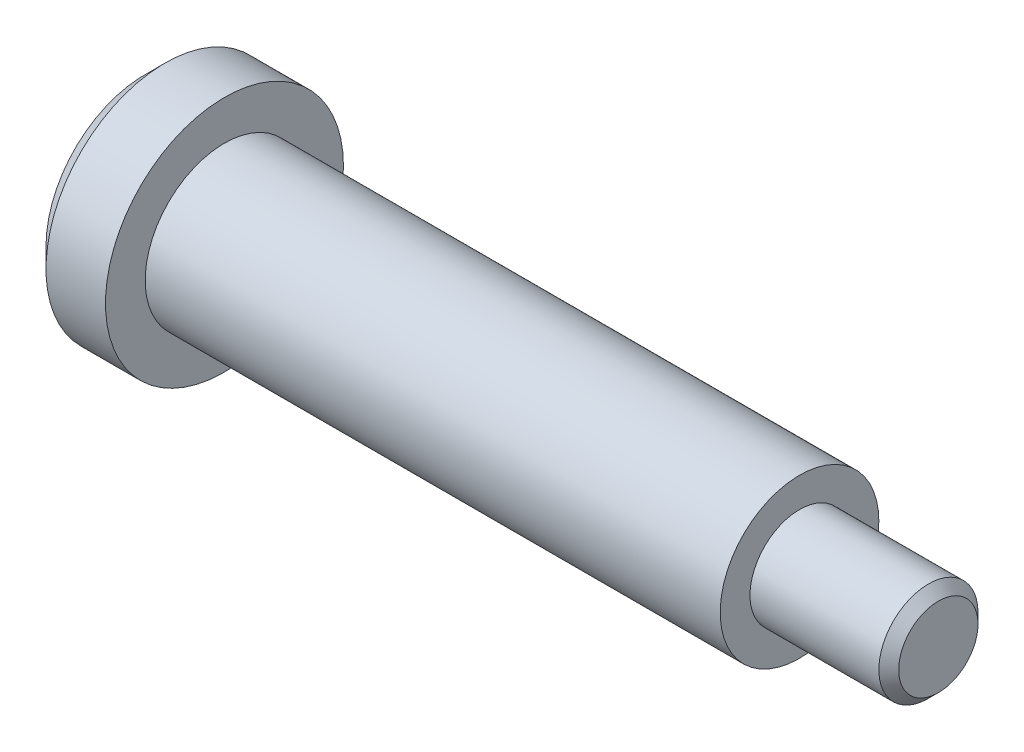
ISO-10303-21;
HEADER;
FILE_DESCRIPTION(('STEP AP214'),'2;1');
FILE_NAME('part.step','',(''),(''),'','','');
FILE_SCHEMA(('AUTOMOTIVE_DESIGN { 1 0 10303 214 1 1 1 1 }'));
ENDSEC;
DATA;
#1=APPLICATION_CONTEXT('core data for automotive mechanical design processes');
#2=APPLICATION_PROTOCOL_DEFINITION('international standard','automotive_design',2000,#1);
#3=PRODUCT_CONTEXT('',#1,'mechanical');
#4=PRODUCT('Part','Part','',(#3));
#5=PRODUCT_RELATED_PRODUCT_CATEGORY('part','',(#4));
#6=PRODUCT_DEFINITION_FORMATION('','',#4);
#7=PRODUCT_DEFINITION_CONTEXT('part definition',#1,'design');
#8=PRODUCT_DEFINITION('design','',#6,#7);
#9=PRODUCT_DEFINITION_SHAPE('','',#8);
#10=(LENGTH_UNIT() NAMED_UNIT(*) SI_UNIT(.MILLI.,.METRE.));
#11=(NAMED_UNIT(*) PLANE_ANGLE_UNIT() SI_UNIT($,.RADIAN.));
#12=(NAMED_UNIT(*) SI_UNIT($,.STERADIAN.) SOLID_ANGLE_UNIT());
#13=UNCERTAINTY_MEASURE_WITH_UNIT(LENGTH_MEASURE(1.E-05),#10,'distance_accuracy_value','');
#14=(GEOMETRIC_REPRESENTATION_CONTEXT(3) GLOBAL_UNCERTAINTY_ASSIGNED_CONTEXT((#13)) GLOBAL_UNIT_ASSIGNED_CONTEXT((#10,
#11,#12)) REPRESENTATION_CONTEXT('',''));
#15=CARTESIAN_POINT('',(0.,0.,0.));
#16=DIRECTION('',(0.,0.,1.));
#17=DIRECTION('',(1.,0.,0.));
#18=AXIS2_PLACEMENT_3D('',#15,#16,#17);
#19=CARTESIAN_POINT('',(4.,0.,0.));
#20=DIRECTION('',(-1.,0.,0.));
#21=DIRECTION('',(0.,0.,1.));
#22=AXIS2_PLACEMENT_3D('',#19,#20,#21);
#23=CYLINDRICAL_SURFACE('',#22,6.);
#24=CARTESIAN_POINT('',(0.999999999999999,0.,0.));
#25=DIRECTION('',(1.,0.,0.));
#26=DIRECTION('',(0.,0.,-1.));
#27=AXIS2_PLACEMENT_3D('',#24,#25,#26);
#28=CIRCLE('',#27,6.);
#29=CARTESIAN_POINT('',(0.999999999999999,0.,-6.));
#30=VERTEX_POINT('',#29);
#31=EDGE_CURVE('E45',#30,#30,#28,.T.);
#32=ORIENTED_EDGE('',*,*,#31,.T.);
#33=EDGE_LOOP('',(#32));
#34=FACE_BOUND('',#33,.T.);
#35=CARTESIAN_POINT('',(4.,0.,0.));
#36=DIRECTION('',(1.,0.,0.));
#37=DIRECTION('',(0.,0.,-1.));
#38=AXIS2_PLACEMENT_3D('',#35,#36,#37);
#39=CIRCLE('',#38,6.);
#40=CARTESIAN_POINT('',(4.,0.,-6.));
#41=VERTEX_POINT('',#40);
#42=EDGE_CURVE('E57',#41,#41,#39,.T.);
#43=ORIENTED_EDGE('',*,*,#42,.F.);
#44=EDGE_LOOP('',(#43));
#45=FACE_BOUND('',#44,.T.);
#46=ADVANCED_FACE('F30',(#34,#45),#23,.T.);
#47=CARTESIAN_POINT('',(4.,0.,0.));
#48=DIRECTION('',(1.,0.,0.));
#49=DIRECTION('',(0.,0.,-1.));
#50=AXIS2_PLACEMENT_3D('',#47,#48,#49);
#51=PLANE('',#50);
#52=CARTESIAN_POINT('',(4.,0.,0.));
#53=DIRECTION('',(1.,0.,0.));
#54=DIRECTION('',(0.,0.,-1.));
#55=AXIS2_PLACEMENT_3D('',#52,#53,#54);
#56=CIRCLE('',#55,4.);
#57=CARTESIAN_POINT('',(4.,0.,-4.));
#58=VERTEX_POINT('',#57);
#59=EDGE_CURVE('E60',#58,#58,#56,.T.);
#60=ORIENTED_EDGE('',*,*,#59,.F.);
#61=EDGE_LOOP('',(#60));
#62=FACE_BOUND('',#61,.T.);
#63=ORIENTED_EDGE('',*,*,#42,.T.);
#64=EDGE_LOOP('',(#63));
#65=FACE_BOUND('',#64,.T.);
#66=ADVANCED_FACE('F87',(#62,#65),#51,.T.);
#67=CARTESIAN_POINT('',(0.,0.,0.));
#68=DIRECTION('',(1.,0.,0.));
#69=DIRECTION('',(0.,0.,-1.));
#70=AXIS2_PLACEMENT_3D('',#67,#68,#69);
#71=PLANE('',#70);
#72=CARTESIAN_POINT('',(0.,0.,0.));
#73=DIRECTION('',(1.,0.,0.));
#74=DIRECTION('',(0.,0.,-1.));
#75=AXIS2_PLACEMENT_3D('',#72,#73,#74);
#76=CIRCLE('',#75,3.);
#77=CARTESIAN_POINT('',(0.,0.,-3.));
#78=VERTEX_POINT('',#77);
#79=EDGE_CURVE('E10',#78,#78,#76,.T.);
#80=ORIENTED_EDGE('',*,*,#79,.T.);
#81=EDGE_LOOP('',(#80));
#82=FACE_BOUND('',#81,.T.);
#83=CARTESIAN_POINT('',(0.,0.,0.));
#84=DIRECTION('',(1.,0.,0.));
#85=DIRECTION('',(0.,0.,-1.));
#86=AXIS2_PLACEMENT_3D('',#83,#84,#85);
#87=CIRCLE('',#86,5.);
#88=CARTESIAN_POINT('',(0.,0.,-5.));
#89=VERTEX_POINT('',#88);
#90=EDGE_CURVE('E41',#89,#89,#87,.F.);
#91=ORIENTED_EDGE('',*,*,#90,.T.);
#92=EDGE_LOOP('',(#91));
#93=FACE_BOUND('',#92,.T.);
#94=ADVANCED_FACE('F93',(#82,#93),#71,.F.);
#95=CARTESIAN_POINT('',(33.,0.,0.));
#96=DIRECTION('',(-1.,0.,0.));
#97=DIRECTION('',(0.,0.,1.));
#98=AXIS2_PLACEMENT_3D('',#95,#96,#97);
#99=CYLINDRICAL_SURFACE('',#98,4.);
#100=CARTESIAN_POINT('',(33.,0.,0.));
#101=DIRECTION('',(1.,0.,0.));
#102=DIRECTION('',(0.,0.,-1.));
#103=AXIS2_PLACEMENT_3D('',#100,#101,#102);
#104=CIRCLE('',#103,4.);
#105=CARTESIAN_POINT('',(33.,0.,-4.));
#106=VERTEX_POINT('',#105);
#107=EDGE_CURVE('E61',#106,#106,#104,.T.);
#108=ORIENTED_EDGE('',*,*,#107,.F.);
#109=EDGE_LOOP('',(#108));
#110=FACE_BOUND('',#109,.T.);
#111=ORIENTED_EDGE('',*,*,#59,.T.);
#112=EDGE_LOOP('',(#111));
#113=FACE_BOUND('',#112,.T.);
#114=ADVANCED_FACE('F119',(#110,#113),#99,.T.);
#115=CARTESIAN_POINT('',(33.,0.,0.));
#116=DIRECTION('',(1.,0.,0.));
#117=DIRECTION('',(0.,0.,-1.));
#118=AXIS2_PLACEMENT_3D('',#115,#116,#117);
#119=PLANE('',#118);
#120=CARTESIAN_POINT('',(33.,0.,0.));
#121=DIRECTION('',(1.,0.,0.));
#122=DIRECTION('',(0.,0.,-1.));
#123=AXIS2_PLACEMENT_3D('',#120,#121,#122);
#124=CIRCLE('',#123,2.5);
#125=CARTESIAN_POINT('',(33.,0.,-2.5));
#126=VERTEX_POINT('',#125);
#127=EDGE_CURVE('E56',#126,#126,#124,.T.);
#128=ORIENTED_EDGE('',*,*,#127,.F.);
#129=EDGE_LOOP('',(#128));
#130=FACE_BOUND('',#129,.T.);
#131=ORIENTED_EDGE('',*,*,#107,.T.);
#132=EDGE_LOOP('',(#131));
#133=FACE_BOUND('',#132,.T.);
#134=ADVANCED_FACE('F113',(#130,#133),#119,.T.);
#135=CARTESIAN_POINT('',(40.,0.,0.));
#136=DIRECTION('',(-1.,0.,0.));
#137=DIRECTION('',(0.,0.,1.));
#138=AXIS2_PLACEMENT_3D('',#135,#136,#137);
#139=CYLINDRICAL_SURFACE('',#138,2.5);
#140=CARTESIAN_POINT('',(39.5,0.,0.));
#141=DIRECTION('',(1.,0.,0.));
#142=DIRECTION('',(0.,0.,-1.));
#143=AXIS2_PLACEMENT_3D('',#140,#141,#142);
#144=CIRCLE('',#143,2.5);
#145=CARTESIAN_POINT('',(39.5,0.,-2.5));
#146=VERTEX_POINT('',#145);
#147=EDGE_CURVE('E50',#146,#146,#144,.F.);
#148=ORIENTED_EDGE('',*,*,#147,.T.);
#149=EDGE_LOOP('',(#148));
#150=FACE_BOUND('',#149,.T.);
#151=ORIENTED_EDGE('',*,*,#127,.T.);
#152=EDGE_LOOP('',(#151));
#153=FACE_BOUND('',#152,.T.);
#154=ADVANCED_FACE('F105',(#150,#153),#139,.T.);
#155=CARTESIAN_POINT('',(40.,0.,0.));
#156=DIRECTION('',(1.,0.,0.));
#157=DIRECTION('',(0.,0.,-1.));
#158=AXIS2_PLACEMENT_3D('',#155,#156,#157);
#159=PLANE('',#158);
#160=CARTESIAN_POINT('',(40.,0.,0.));
#161=DIRECTION('',(1.,0.,0.));
#162=DIRECTION('',(0.,0.,-1.));
#163=AXIS2_PLACEMENT_3D('',#160,#161,#162);
#164=CIRCLE('',#163,2.);
#165=CARTESIAN_POINT('',(40.,0.,-2.));
#166=VERTEX_POINT('',#165);
#167=EDGE_CURVE('E53',#166,#166,#164,.T.);
#168=ORIENTED_EDGE('',*,*,#167,.T.);
#169=EDGE_LOOP('',(#168));
#170=FACE_BOUND('',#169,.T.);
#171=ADVANCED_FACE('F100',(#170),#159,.T.);
#172=CARTESIAN_POINT('',(40.,0.,0.));
#173=DIRECTION('',(-1.,0.,0.));
#174=DIRECTION('',(0.,0.,1.));
#175=AXIS2_PLACEMENT_3D('',#172,#173,#174);
#176=CONICAL_SURFACE('',#175,2.,0.785398163397446);
#177=ORIENTED_EDGE('',*,*,#147,.F.);
#178=EDGE_LOOP('',(#177));
#179=FACE_BOUND('',#178,.T.);
#180=ORIENTED_EDGE('',*,*,#167,.F.);
#181=EDGE_LOOP('',(#180));
#182=FACE_BOUND('',#181,.T.);
#183=ADVANCED_FACE('F83',(#179,#182),#176,.T.);
#184=CARTESIAN_POINT('',(0.999999999999999,0.,0.));
#185=DIRECTION('',(1.,0.,0.));
#186=DIRECTION('',(0.,0.,-1.));
#187=AXIS2_PLACEMENT_3D('',#184,#185,#186);
#188=CONICAL_SURFACE('',#187,6.,0.78539816339745);
#189=ORIENTED_EDGE('',*,*,#90,.F.);
#190=EDGE_LOOP('',(#189));
#191=FACE_BOUND('',#190,.T.);
#192=ORIENTED_EDGE('',*,*,#31,.F.);
#193=EDGE_LOOP('',(#192));
#194=FACE_BOUND('',#193,.T.);
#195=ADVANCED_FACE('F76',(#191,#194),#188,.T.);
#196=CARTESIAN_POINT('',(1.,0.,0.));
#197=DIRECTION('',(-1.,0.,0.));
#198=DIRECTION('',(0.,0.,1.));
#199=AXIS2_PLACEMENT_3D('',#196,#197,#198);
#200=CYLINDRICAL_SURFACE('',#199,2.5);
#201=CARTESIAN_POINT('',(0.5,0.,0.));
#202=DIRECTION('',(1.,0.,0.));
#203=DIRECTION('',(0.,0.,-1.));
#204=AXIS2_PLACEMENT_3D('',#201,#202,#203);
#205=CIRCLE('',#204,2.5);
#206=CARTESIAN_POINT('',(0.5,0.,-2.5));
#207=VERTEX_POINT('',#206);
#208=EDGE_CURVE('E37',#207,#207,#205,.F.);
#209=ORIENTED_EDGE('',*,*,#208,.T.);
#210=EDGE_LOOP('',(#209));
#211=FACE_BOUND('',#210,.T.);
#212=CARTESIAN_POINT('',(1.,0.,0.));
#213=DIRECTION('',(-1.,0.,0.));
#214=DIRECTION('',(0.,0.,1.));
#215=AXIS2_PLACEMENT_3D('',#212,#213,#214);
#216=CIRCLE('',#215,2.5);
#217=CARTESIAN_POINT('',(1.,0.,2.5));
#218=VERTEX_POINT('',#217);
#219=EDGE_CURVE('E66',#218,#218,#216,.T.);
#220=ORIENTED_EDGE('',*,*,#219,.F.);
#221=EDGE_LOOP('',(#220));
#222=FACE_BOUND('',#221,.T.);
#223=ADVANCED_FACE('F74',(#211,#222),#200,.F.);
#224=CARTESIAN_POINT('',(1.,0.,0.));
#225=DIRECTION('',(-1.,0.,0.));
#226=DIRECTION('',(0.,0.,1.));
#227=AXIS2_PLACEMENT_3D('',#224,#225,#226);
#228=PLANE('',#227);
#229=ORIENTED_EDGE('',*,*,#219,.T.);
#230=EDGE_LOOP('',(#229));
#231=FACE_BOUND('',#230,.T.);
#232=ADVANCED_FACE('F72',(#231),#228,.T.);
#233=CARTESIAN_POINT('',(0.5,0.,0.));
#234=DIRECTION('',(1.,0.,0.));
#235=DIRECTION('',(0.,0.,-1.));
#236=AXIS2_PLACEMENT_3D('',#233,#234,#235);
#237=TOROIDAL_SURFACE('',#236,3.,0.5);
#238=ORIENTED_EDGE('',*,*,#79,.F.);
#239=EDGE_LOOP('',(#238));
#240=FACE_BOUND('',#239,.T.);
#241=ORIENTED_EDGE('',*,*,#208,.F.);
#242=EDGE_LOOP('',(#241));
#243=FACE_BOUND('',#242,.T.);
#244=ADVANCED_FACE('F32',(#240,#243),#237,.T.);
#245=CLOSED_SHELL('',(#46,#66,#94,#114,#134,#154,#171,#183,#195,#223,#232,#244));
#246=MANIFOLD_SOLID_BREP('B2',#245);
#247=ADVANCED_BREP_SHAPE_REPRESENTATION('',(#18,#246),#14);
#248=SHAPE_DEFINITION_REPRESENTATION(#9,#247);
ENDSEC;
END-ISO-10303-21;
